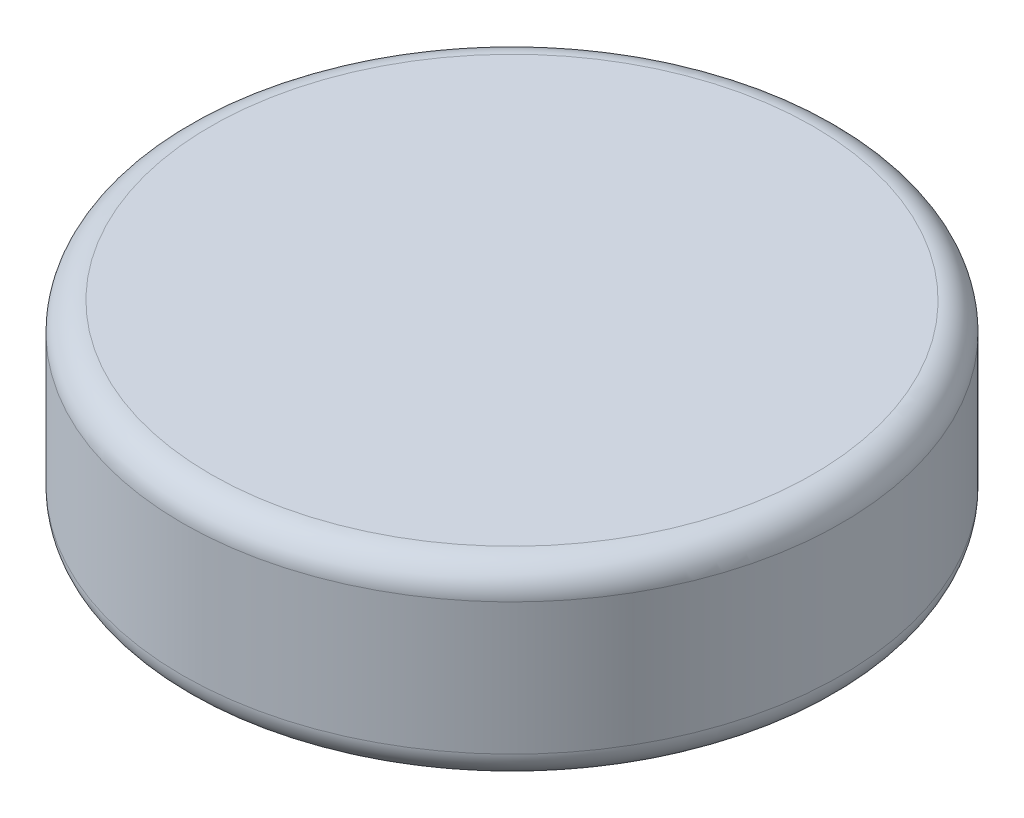
ISO-10303-21;
HEADER;
FILE_DESCRIPTION(('STEP AP214'),'2;1');
FILE_NAME('part.step','',(''),(''),'','','');
FILE_SCHEMA(('AUTOMOTIVE_DESIGN { 1 0 10303 214 1 1 1 1 }'));
ENDSEC;
DATA;
#1=APPLICATION_CONTEXT('core data for automotive mechanical design processes');
#2=APPLICATION_PROTOCOL_DEFINITION('international standard','automotive_design',2000,#1);
#3=PRODUCT_CONTEXT('',#1,'mechanical');
#4=PRODUCT('Part','Part','',(#3));
#5=PRODUCT_RELATED_PRODUCT_CATEGORY('part','',(#4));
#6=PRODUCT_DEFINITION_FORMATION('','',#4);
#7=PRODUCT_DEFINITION_CONTEXT('part definition',#1,'design');
#8=PRODUCT_DEFINITION('design','',#6,#7);
#9=PRODUCT_DEFINITION_SHAPE('','',#8);
#10=(LENGTH_UNIT() NAMED_UNIT(*) SI_UNIT(.MILLI.,.METRE.));
#11=(NAMED_UNIT(*) PLANE_ANGLE_UNIT() SI_UNIT($,.RADIAN.));
#12=(NAMED_UNIT(*) SI_UNIT($,.STERADIAN.) SOLID_ANGLE_UNIT());
#13=UNCERTAINTY_MEASURE_WITH_UNIT(LENGTH_MEASURE(1.E-05),#10,'distance_accuracy_value','');
#14=(GEOMETRIC_REPRESENTATION_CONTEXT(3) GLOBAL_UNCERTAINTY_ASSIGNED_CONTEXT((#13)) GLOBAL_UNIT_ASSIGNED_CONTEXT((#10,
#11,#12)) REPRESENTATION_CONTEXT('',''));
#15=CARTESIAN_POINT('',(0.,0.,0.));
#16=DIRECTION('',(0.,0.,1.));
#17=DIRECTION('',(1.,0.,0.));
#18=AXIS2_PLACEMENT_3D('',#15,#16,#17);
#19=CARTESIAN_POINT('',(0.,2.,0.));
#20=DIRECTION('',(0.,-1.,0.));
#21=DIRECTION('',(0.,0.,-1.));
#22=AXIS2_PLACEMENT_3D('',#19,#20,#21);
#23=CYLINDRICAL_SURFACE('',#22,3.5);
#24=CARTESIAN_POINT('',(0.,0.3,0.));
#25=DIRECTION('',(0.,1.,0.));
#26=DIRECTION('',(0.,0.,1.));
#27=AXIS2_PLACEMENT_3D('',#24,#25,#26);
#28=CIRCLE('',#27,3.5);
#29=CARTESIAN_POINT('',(0.,0.3,3.5));
#30=VERTEX_POINT('',#29);
#31=EDGE_CURVE('E44',#30,#30,#28,.T.);
#32=ORIENTED_EDGE('',*,*,#31,.T.);
#33=EDGE_LOOP('',(#32));
#34=FACE_BOUND('',#33,.T.);
#35=CARTESIAN_POINT('',(0.,1.7,0.));
#36=DIRECTION('',(0.,1.,0.));
#37=DIRECTION('',(0.,0.,1.));
#38=AXIS2_PLACEMENT_3D('',#35,#36,#37);
#39=CIRCLE('',#38,3.5);
#40=CARTESIAN_POINT('',(0.,1.7,3.5));
#41=VERTEX_POINT('',#40);
#42=EDGE_CURVE('E48',#41,#41,#39,.F.);
#43=ORIENTED_EDGE('',*,*,#42,.T.);
#44=EDGE_LOOP('',(#43));
#45=FACE_BOUND('',#44,.T.);
#46=ADVANCED_FACE('F33',(#34,#45),#23,.T.);
#47=CARTESIAN_POINT('',(0.,2.,0.));
#48=DIRECTION('',(0.,1.,0.));
#49=DIRECTION('',(0.,0.,1.));
#50=AXIS2_PLACEMENT_3D('',#47,#48,#49);
#51=PLANE('',#50);
#52=CARTESIAN_POINT('',(0.,2.,0.));
#53=DIRECTION('',(0.,1.,0.));
#54=DIRECTION('',(0.,0.,1.));
#55=AXIS2_PLACEMENT_3D('',#52,#53,#54);
#56=CIRCLE('',#55,3.2);
#57=CARTESIAN_POINT('',(0.,2.,3.2));
#58=VERTEX_POINT('',#57);
#59=EDGE_CURVE('E10',#58,#58,#56,.T.);
#60=ORIENTED_EDGE('',*,*,#59,.T.);
#61=EDGE_LOOP('',(#60));
#62=FACE_BOUND('',#61,.T.);
#63=ADVANCED_FACE('F64',(#62),#51,.T.);
#64=CARTESIAN_POINT('',(0.,0.,0.));
#65=DIRECTION('',(0.,1.,0.));
#66=DIRECTION('',(0.,0.,1.));
#67=AXIS2_PLACEMENT_3D('',#64,#65,#66);
#68=PLANE('',#67);
#69=CARTESIAN_POINT('',(0.,0.,0.));
#70=DIRECTION('',(0.,1.,0.));
#71=DIRECTION('',(0.,0.,1.));
#72=AXIS2_PLACEMENT_3D('',#69,#70,#71);
#73=CIRCLE('',#72,3.2);
#74=CARTESIAN_POINT('',(0.,0.,3.2));
#75=VERTEX_POINT('',#74);
#76=EDGE_CURVE('E40',#75,#75,#73,.F.);
#77=ORIENTED_EDGE('',*,*,#76,.T.);
#78=EDGE_LOOP('',(#77));
#79=FACE_BOUND('',#78,.T.);
#80=ADVANCED_FACE('F61',(#79),#68,.F.);
#81=CARTESIAN_POINT('',(0.,0.3,0.));
#82=DIRECTION('',(0.,1.,0.));
#83=DIRECTION('',(0.,0.,1.));
#84=AXIS2_PLACEMENT_3D('',#81,#82,#83);
#85=TOROIDAL_SURFACE('',#84,3.2,0.3);
#86=ORIENTED_EDGE('',*,*,#76,.F.);
#87=EDGE_LOOP('',(#86));
#88=FACE_BOUND('',#87,.T.);
#89=ORIENTED_EDGE('',*,*,#31,.F.);
#90=EDGE_LOOP('',(#89));
#91=FACE_BOUND('',#90,.T.);
#92=ADVANCED_FACE('F57',(#88,#91),#85,.T.);
#93=CARTESIAN_POINT('',(0.,1.7,0.));
#94=DIRECTION('',(0.,1.,0.));
#95=DIRECTION('',(0.,0.,1.));
#96=AXIS2_PLACEMENT_3D('',#93,#94,#95);
#97=TOROIDAL_SURFACE('',#96,3.2,0.3);
#98=ORIENTED_EDGE('',*,*,#42,.F.);
#99=EDGE_LOOP('',(#98));
#100=FACE_BOUND('',#99,.T.);
#101=ORIENTED_EDGE('',*,*,#59,.F.);
#102=EDGE_LOOP('',(#101));
#103=FACE_BOUND('',#102,.T.);
#104=ADVANCED_FACE('F35',(#100,#103),#97,.T.);
#105=CLOSED_SHELL('',(#46,#63,#80,#92,#104));
#106=MANIFOLD_SOLID_BREP('B2',#105);
#107=ADVANCED_BREP_SHAPE_REPRESENTATION('',(#18,#106),#14);
#108=SHAPE_DEFINITION_REPRESENTATION(#9,#107);
ENDSEC;
END-ISO-10303-21;
